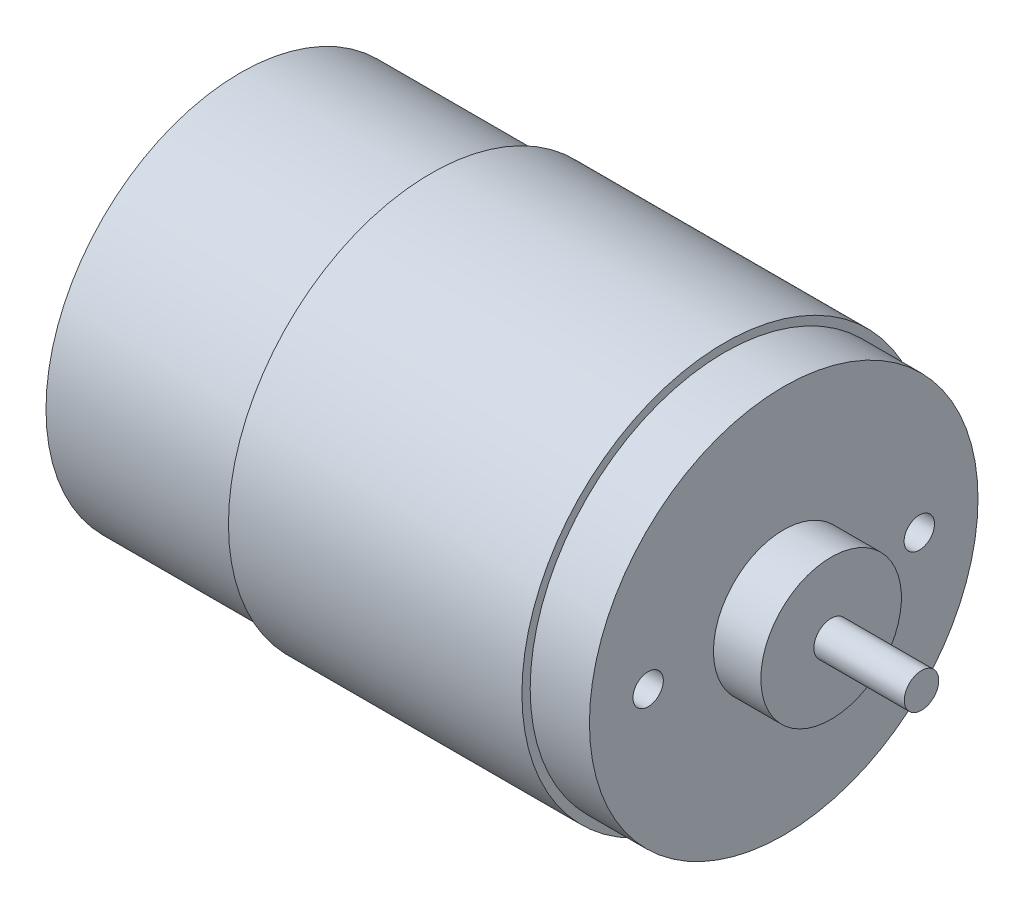
ISO-10303-21;
HEADER;
FILE_DESCRIPTION(('STEP AP214'),'2;1');
FILE_NAME('part.step','',(''),(''),'','','');
FILE_SCHEMA(('AUTOMOTIVE_DESIGN { 1 0 10303 214 1 1 1 1 }'));
ENDSEC;
DATA;
#1=APPLICATION_CONTEXT('core data for automotive mechanical design processes');
#2=APPLICATION_PROTOCOL_DEFINITION('international standard','automotive_design',2000,#1);
#3=PRODUCT_CONTEXT('',#1,'mechanical');
#4=PRODUCT('Part','Part','',(#3));
#5=PRODUCT_RELATED_PRODUCT_CATEGORY('part','',(#4));
#6=PRODUCT_DEFINITION_FORMATION('','',#4);
#7=PRODUCT_DEFINITION_CONTEXT('part definition',#1,'design');
#8=PRODUCT_DEFINITION('design','',#6,#7);
#9=PRODUCT_DEFINITION_SHAPE('','',#8);
#10=(LENGTH_UNIT() NAMED_UNIT(*) SI_UNIT(.MILLI.,.METRE.));
#11=(NAMED_UNIT(*) PLANE_ANGLE_UNIT() SI_UNIT($,.RADIAN.));
#12=(NAMED_UNIT(*) SI_UNIT($,.STERADIAN.) SOLID_ANGLE_UNIT());
#13=UNCERTAINTY_MEASURE_WITH_UNIT(LENGTH_MEASURE(1.E-05),#10,'distance_accuracy_value','');
#14=(GEOMETRIC_REPRESENTATION_CONTEXT(3) GLOBAL_UNCERTAINTY_ASSIGNED_CONTEXT((#13)) GLOBAL_UNIT_ASSIGNED_CONTEXT((#10,
#11,#12)) REPRESENTATION_CONTEXT('',''));
#15=CARTESIAN_POINT('',(0.,0.,0.));
#16=DIRECTION('',(0.,0.,1.));
#17=DIRECTION('',(1.,0.,0.));
#18=AXIS2_PLACEMENT_3D('',#15,#16,#17);
#19=CARTESIAN_POINT('',(-29.8040836820084,0.,0.));
#20=DIRECTION('',(1.,0.,0.));
#21=DIRECTION('',(0.,0.,-1.));
#22=AXIS2_PLACEMENT_3D('',#19,#20,#21);
#23=PLANE('',#22);
#24=CARTESIAN_POINT('',(-29.8040836820084,0.,0.));
#25=DIRECTION('',(-1.,0.,0.));
#26=DIRECTION('',(0.,0.,1.));
#27=AXIS2_PLACEMENT_3D('',#24,#25,#26);
#28=CIRCLE('',#27,1.53462761506276);
#29=CARTESIAN_POINT('',(-29.8040836820084,0.,1.53462761506276));
#30=VERTEX_POINT('',#29);
#31=EDGE_CURVE('E10',#30,#30,#28,.T.);
#32=ORIENTED_EDGE('',*,*,#31,.T.);
#33=EDGE_LOOP('',(#32));
#34=FACE_BOUND('',#33,.T.);
#35=ADVANCED_FACE('F33',(#34),#23,.F.);
#36=CARTESIAN_POINT('',(-37.6387615062761,0.,0.));
#37=DIRECTION('',(-1.,0.,0.));
#38=DIRECTION('',(0.,0.,1.));
#39=AXIS2_PLACEMENT_3D('',#36,#37,#38);
#40=CYLINDRICAL_SURFACE('',#39,1.53462761506276);
#41=ORIENTED_EDGE('',*,*,#31,.F.);
#42=EDGE_LOOP('',(#41));
#43=FACE_BOUND('',#42,.T.);
#44=CARTESIAN_POINT('',(-28.9156150627615,0.,0.));
#45=DIRECTION('',(-1.,0.,0.));
#46=DIRECTION('',(0.,0.,1.));
#47=AXIS2_PLACEMENT_3D('',#44,#45,#46);
#48=CIRCLE('',#47,1.53462761506276);
#49=CARTESIAN_POINT('',(-28.9156150627615,0.,1.53462761506276));
#50=VERTEX_POINT('',#49);
#51=EDGE_CURVE('E39',#50,#50,#48,.T.);
#52=ORIENTED_EDGE('',*,*,#51,.T.);
#53=EDGE_LOOP('',(#52));
#54=FACE_BOUND('',#53,.T.);
#55=ADVANCED_FACE('F152',(#43,#54),#40,.T.);
#56=CARTESIAN_POINT('',(-28.9156150627615,1.53462761506276,0.));
#57=DIRECTION('',(1.,0.,0.));
#58=DIRECTION('',(0.,0.,-1.));
#59=AXIS2_PLACEMENT_3D('',#56,#57,#58);
#60=PLANE('',#59);
#61=ORIENTED_EDGE('',*,*,#51,.F.);
#62=EDGE_LOOP('',(#61));
#63=FACE_BOUND('',#62,.T.);
#64=CARTESIAN_POINT('',(-28.9156150627615,0.,0.));
#65=DIRECTION('',(-1.,0.,0.));
#66=DIRECTION('',(0.,0.,1.));
#67=AXIS2_PLACEMENT_3D('',#64,#65,#66);
#68=CIRCLE('',#67,2.66540585774058);
#69=CARTESIAN_POINT('',(-28.9156150627615,0.,2.66540585774058));
#70=VERTEX_POINT('',#69);
#71=EDGE_CURVE('E43',#70,#70,#68,.T.);
#72=ORIENTED_EDGE('',*,*,#71,.T.);
#73=EDGE_LOOP('',(#72));
#74=FACE_BOUND('',#73,.T.);
#75=ADVANCED_FACE('F156',(#63,#74),#60,.F.);
#76=CARTESIAN_POINT('',(-37.6387615062761,0.,0.));
#77=DIRECTION('',(-1.,0.,0.));
#78=DIRECTION('',(0.,0.,1.));
#79=AXIS2_PLACEMENT_3D('',#76,#77,#78);
#80=CYLINDRICAL_SURFACE('',#79,2.66540585774058);
#81=ORIENTED_EDGE('',*,*,#71,.F.);
#82=EDGE_LOOP('',(#81));
#83=FACE_BOUND('',#82,.T.);
#84=CARTESIAN_POINT('',(-27.6232970711297,0.,0.));
#85=DIRECTION('',(-1.,0.,0.));
#86=DIRECTION('',(0.,0.,1.));
#87=AXIS2_PLACEMENT_3D('',#84,#85,#86);
#88=CIRCLE('',#87,2.66540585774058);
#89=CARTESIAN_POINT('',(-27.6232970711297,0.,2.66540585774058));
#90=VERTEX_POINT('',#89);
#91=EDGE_CURVE('E47',#90,#90,#88,.T.);
#92=ORIENTED_EDGE('',*,*,#91,.T.);
#93=EDGE_LOOP('',(#92));
#94=FACE_BOUND('',#93,.T.);
#95=ADVANCED_FACE('F161',(#83,#94),#80,.T.);
#96=CARTESIAN_POINT('',(-27.6232970711297,2.66540585774058,0.));
#97=DIRECTION('',(1.,0.,0.));
#98=DIRECTION('',(0.,0.,-1.));
#99=AXIS2_PLACEMENT_3D('',#96,#97,#98);
#100=PLANE('',#99);
#101=ORIENTED_EDGE('',*,*,#91,.F.);
#102=EDGE_LOOP('',(#101));
#103=FACE_BOUND('',#102,.T.);
#104=CARTESIAN_POINT('',(-27.6232970711297,0.,0.));
#105=DIRECTION('',(-1.,0.,0.));
#106=DIRECTION('',(0.,0.,1.));
#107=AXIS2_PLACEMENT_3D('',#104,#105,#106);
#108=CIRCLE('',#107,4.76542259414226);
#109=CARTESIAN_POINT('',(-27.6232970711297,0.,4.76542259414226));
#110=VERTEX_POINT('',#109);
#111=EDGE_CURVE('E52',#110,#110,#108,.T.);
#112=ORIENTED_EDGE('',*,*,#111,.T.);
#113=EDGE_LOOP('',(#112));
#114=FACE_BOUND('',#113,.T.);
#115=ADVANCED_FACE('F167',(#103,#114),#100,.F.);
#116=CARTESIAN_POINT('',(-26.6944435146444,0.,0.));
#117=DIRECTION('',(1.,0.,0.));
#118=DIRECTION('',(0.,0.,-1.));
#119=AXIS2_PLACEMENT_3D('',#116,#117,#118);
#120=CONICAL_SURFACE('',#119,5.69427615062763,0.785398163397459);
#121=ORIENTED_EDGE('',*,*,#111,.F.);
#122=EDGE_LOOP('',(#121));
#123=FACE_BOUND('',#122,.T.);
#124=CARTESIAN_POINT('',(-26.6944435146444,0.,0.));
#125=DIRECTION('',(-1.,0.,0.));
#126=DIRECTION('',(0.,0.,1.));
#127=AXIS2_PLACEMENT_3D('',#124,#125,#126);
#128=CIRCLE('',#127,5.69427615062763);
#129=CARTESIAN_POINT('',(-26.6944435146444,0.,5.69427615062763));
#130=VERTEX_POINT('',#129);
#131=EDGE_CURVE('E55',#130,#130,#128,.T.);
#132=ORIENTED_EDGE('',*,*,#131,.T.);
#133=EDGE_LOOP('',(#132));
#134=FACE_BOUND('',#133,.T.);
#135=ADVANCED_FACE('F171',(#123,#134),#120,.T.);
#136=CARTESIAN_POINT('',(-37.6387615062761,0.,0.));
#137=DIRECTION('',(-1.,0.,0.));
#138=DIRECTION('',(0.,0.,1.));
#139=AXIS2_PLACEMENT_3D('',#136,#137,#138);
#140=CYLINDRICAL_SURFACE('',#139,5.69427615062762);
#141=ORIENTED_EDGE('',*,*,#131,.F.);
#142=EDGE_LOOP('',(#141));
#143=FACE_BOUND('',#142,.T.);
#144=CARTESIAN_POINT('',(-24.6478836820084,0.,0.));
#145=DIRECTION('',(-1.,0.,0.));
#146=DIRECTION('',(0.,0.,1.));
#147=AXIS2_PLACEMENT_3D('',#144,#145,#146);
#148=CIRCLE('',#147,5.69427615062762);
#149=CARTESIAN_POINT('',(-24.6478836820084,0.,5.69427615062762));
#150=VERTEX_POINT('',#149);
#151=EDGE_CURVE('E58',#150,#150,#148,.T.);
#152=ORIENTED_EDGE('',*,*,#151,.T.);
#153=EDGE_LOOP('',(#152));
#154=FACE_BOUND('',#153,.T.);
#155=ADVANCED_FACE('F175',(#143,#154),#140,.T.);
#156=CARTESIAN_POINT('',(-24.6478836820084,5.69427615062762,0.));
#157=DIRECTION('',(1.,0.,0.));
#158=DIRECTION('',(0.,0.,-1.));
#159=AXIS2_PLACEMENT_3D('',#156,#157,#158);
#160=PLANE('',#159);
#161=ORIENTED_EDGE('',*,*,#151,.F.);
#162=EDGE_LOOP('',(#161));
#163=FACE_BOUND('',#162,.T.);
#164=CARTESIAN_POINT('',(-24.6478836820084,0.,0.));
#165=DIRECTION('',(-1.,0.,0.));
#166=DIRECTION('',(0.,0.,1.));
#167=AXIS2_PLACEMENT_3D('',#164,#165,#166);
#168=CIRCLE('',#167,17.907);
#169=CARTESIAN_POINT('',(-24.6478836820084,0.,17.907));
#170=VERTEX_POINT('',#169);
#171=EDGE_CURVE('E61',#170,#170,#168,.T.);
#172=ORIENTED_EDGE('',*,*,#171,.T.);
#173=EDGE_LOOP('',(#172));
#174=FACE_BOUND('',#173,.T.);
#175=ADVANCED_FACE('F179',(#163,#174),#160,.F.);
#176=CARTESIAN_POINT('',(-37.6387615062761,0.,0.));
#177=DIRECTION('',(-1.,0.,0.));
#178=DIRECTION('',(0.,0.,1.));
#179=AXIS2_PLACEMENT_3D('',#176,#177,#178);
#180=CYLINDRICAL_SURFACE('',#179,17.907);
#181=ORIENTED_EDGE('',*,*,#171,.F.);
#182=EDGE_LOOP('',(#181));
#183=FACE_BOUND('',#182,.T.);
#184=CARTESIAN_POINT('',(-7.07108368200839,0.,0.));
#185=DIRECTION('',(-1.,0.,0.));
#186=DIRECTION('',(0.,0.,1.));
#187=AXIS2_PLACEMENT_3D('',#184,#185,#186);
#188=CIRCLE('',#187,17.907);
#189=CARTESIAN_POINT('',(-7.07108368200839,0.,17.907));
#190=VERTEX_POINT('',#189);
#191=EDGE_CURVE('E64',#190,#190,#188,.T.);
#192=ORIENTED_EDGE('',*,*,#191,.T.);
#193=EDGE_LOOP('',(#192));
#194=FACE_BOUND('',#193,.T.);
#195=ADVANCED_FACE('F183',(#183,#194),#180,.T.);
#196=CARTESIAN_POINT('',(-7.07108368200839,17.907,0.));
#197=DIRECTION('',(1.,0.,0.));
#198=DIRECTION('',(0.,0.,-1.));
#199=AXIS2_PLACEMENT_3D('',#196,#197,#198);
#200=PLANE('',#199);
#201=ORIENTED_EDGE('',*,*,#191,.F.);
#202=EDGE_LOOP('',(#201));
#203=FACE_BOUND('',#202,.T.);
#204=CARTESIAN_POINT('',(-7.07108368200839,0.,0.));
#205=DIRECTION('',(-1.,0.,0.));
#206=DIRECTION('',(0.,0.,1.));
#207=AXIS2_PLACEMENT_3D('',#204,#205,#206);
#208=CIRCLE('',#207,18.669);
#209=CARTESIAN_POINT('',(-7.07108368200839,0.,18.669));
#210=VERTEX_POINT('',#209);
#211=EDGE_CURVE('E67',#210,#210,#208,.T.);
#212=ORIENTED_EDGE('',*,*,#211,.T.);
#213=EDGE_LOOP('',(#212));
#214=FACE_BOUND('',#213,.T.);
#215=ADVANCED_FACE('F187',(#203,#214),#200,.F.);
#216=CARTESIAN_POINT('',(-37.6387615062761,0.,0.));
#217=DIRECTION('',(-1.,0.,0.));
#218=DIRECTION('',(0.,0.,1.));
#219=AXIS2_PLACEMENT_3D('',#216,#217,#218);
#220=CYLINDRICAL_SURFACE('',#219,18.669);
#221=ORIENTED_EDGE('',*,*,#211,.F.);
#222=EDGE_LOOP('',(#221));
#223=FACE_BOUND('',#222,.T.);
#224=CARTESIAN_POINT('',(19.9799163179916,0.,0.));
#225=DIRECTION('',(-1.,0.,0.));
#226=DIRECTION('',(0.,0.,1.));
#227=AXIS2_PLACEMENT_3D('',#224,#225,#226);
#228=CIRCLE('',#227,18.669);
#229=CARTESIAN_POINT('',(19.9799163179916,0.,18.669));
#230=VERTEX_POINT('',#229);
#231=EDGE_CURVE('E70',#230,#230,#228,.T.);
#232=ORIENTED_EDGE('',*,*,#231,.T.);
#233=EDGE_LOOP('',(#232));
#234=FACE_BOUND('',#233,.T.);
#235=ADVANCED_FACE('F191',(#223,#234),#220,.T.);
#236=CARTESIAN_POINT('',(19.9799163179916,18.669,0.));
#237=DIRECTION('',(-1.,0.,0.));
#238=DIRECTION('',(0.,0.,1.));
#239=AXIS2_PLACEMENT_3D('',#236,#237,#238);
#240=PLANE('',#239);
#241=ORIENTED_EDGE('',*,*,#231,.F.);
#242=EDGE_LOOP('',(#241));
#243=FACE_BOUND('',#242,.T.);
#244=CARTESIAN_POINT('',(19.9799163179916,0.,0.));
#245=DIRECTION('',(-1.,0.,0.));
#246=DIRECTION('',(0.,0.,1.));
#247=AXIS2_PLACEMENT_3D('',#244,#245,#246);
#248=CIRCLE('',#247,17.907);
#249=CARTESIAN_POINT('',(19.9799163179916,0.,17.907));
#250=VERTEX_POINT('',#249);
#251=EDGE_CURVE('E73',#250,#250,#248,.T.);
#252=ORIENTED_EDGE('',*,*,#251,.T.);
#253=EDGE_LOOP('',(#252));
#254=FACE_BOUND('',#253,.T.);
#255=ADVANCED_FACE('F195',(#243,#254),#240,.F.);
#256=CARTESIAN_POINT('',(-37.6387615062761,0.,0.));
#257=DIRECTION('',(-1.,0.,0.));
#258=DIRECTION('',(0.,0.,1.));
#259=AXIS2_PLACEMENT_3D('',#256,#257,#258);
#260=CYLINDRICAL_SURFACE('',#259,17.907);
#261=ORIENTED_EDGE('',*,*,#251,.F.);
#262=EDGE_LOOP('',(#261));
#263=FACE_BOUND('',#262,.T.);
#264=CARTESIAN_POINT('',(25.4409163179916,0.,0.));
#265=DIRECTION('',(-1.,0.,0.));
#266=DIRECTION('',(0.,0.,1.));
#267=AXIS2_PLACEMENT_3D('',#264,#265,#266);
#268=CIRCLE('',#267,17.907);
#269=CARTESIAN_POINT('',(25.4409163179916,0.,17.907));
#270=VERTEX_POINT('',#269);
#271=EDGE_CURVE('E76',#270,#270,#268,.T.);
#272=ORIENTED_EDGE('',*,*,#271,.T.);
#273=EDGE_LOOP('',(#272));
#274=FACE_BOUND('',#273,.T.);
#275=ADVANCED_FACE('F117',(#263,#274),#260,.T.);
#276=CARTESIAN_POINT('',(25.4409163179916,17.907,0.));
#277=DIRECTION('',(-1.,0.,0.));
#278=DIRECTION('',(0.,0.,1.));
#279=AXIS2_PLACEMENT_3D('',#276,#277,#278);
#280=PLANE('',#279);
#281=CARTESIAN_POINT('',(25.4409163179916,0.,-12.4968));
#282=DIRECTION('',(1.,0.,0.));
#283=DIRECTION('',(0.,0.,1.));
#284=AXIS2_PLACEMENT_3D('',#281,#282,#283);
#285=CIRCLE('',#284,1.4);
#286=CARTESIAN_POINT('',(25.4409163179916,0.,-11.0968));
#287=VERTEX_POINT('',#286);
#288=EDGE_CURVE('E98',#287,#287,#285,.T.);
#289=ORIENTED_EDGE('',*,*,#288,.F.);
#290=EDGE_LOOP('',(#289));
#291=FACE_BOUND('',#290,.T.);
#292=CARTESIAN_POINT('',(25.4409163179916,0.,12.4968));
#293=DIRECTION('',(1.,0.,0.));
#294=DIRECTION('',(0.,0.,-1.));
#295=AXIS2_PLACEMENT_3D('',#292,#293,#294);
#296=CIRCLE('',#295,1.4);
#297=CARTESIAN_POINT('',(25.4409163179916,0.,11.0968));
#298=VERTEX_POINT('',#297);
#299=EDGE_CURVE('E92',#298,#298,#296,.T.);
#300=ORIENTED_EDGE('',*,*,#299,.F.);
#301=EDGE_LOOP('',(#300));
#302=FACE_BOUND('',#301,.T.);
#303=ORIENTED_EDGE('',*,*,#271,.F.);
#304=EDGE_LOOP('',(#303));
#305=FACE_BOUND('',#304,.T.);
#306=CARTESIAN_POINT('',(25.4409163179916,0.,0.));
#307=DIRECTION('',(-1.,0.,0.));
#308=DIRECTION('',(0.,0.,1.));
#309=AXIS2_PLACEMENT_3D('',#306,#307,#308);
#310=CIRCLE('',#309,6.477);
#311=CARTESIAN_POINT('',(25.4409163179916,0.,6.477));
#312=VERTEX_POINT('',#311);
#313=EDGE_CURVE('E79',#312,#312,#310,.T.);
#314=ORIENTED_EDGE('',*,*,#313,.T.);
#315=EDGE_LOOP('',(#314));
#316=FACE_BOUND('',#315,.T.);
#317=ADVANCED_FACE('F113',(#291,#302,#305,#316),#280,.F.);
#318=CARTESIAN_POINT('',(-37.6387615062761,0.,0.));
#319=DIRECTION('',(-1.,0.,0.));
#320=DIRECTION('',(0.,0.,1.));
#321=AXIS2_PLACEMENT_3D('',#318,#319,#320);
#322=CYLINDRICAL_SURFACE('',#321,6.477);
#323=ORIENTED_EDGE('',*,*,#313,.F.);
#324=EDGE_LOOP('',(#323));
#325=FACE_BOUND('',#324,.T.);
#326=CARTESIAN_POINT('',(29.8097163179916,0.,0.));
#327=DIRECTION('',(-1.,0.,0.));
#328=DIRECTION('',(0.,0.,1.));
#329=AXIS2_PLACEMENT_3D('',#326,#327,#328);
#330=CIRCLE('',#329,6.477);
#331=CARTESIAN_POINT('',(29.8097163179916,0.,6.477));
#332=VERTEX_POINT('',#331);
#333=EDGE_CURVE('E82',#332,#332,#330,.T.);
#334=ORIENTED_EDGE('',*,*,#333,.T.);
#335=EDGE_LOOP('',(#334));
#336=FACE_BOUND('',#335,.T.);
#337=ADVANCED_FACE('F116',(#325,#336),#322,.T.);
#338=CARTESIAN_POINT('',(29.8097163179916,6.477,0.));
#339=DIRECTION('',(-1.,0.,0.));
#340=DIRECTION('',(0.,0.,1.));
#341=AXIS2_PLACEMENT_3D('',#338,#339,#340);
#342=PLANE('',#341);
#343=ORIENTED_EDGE('',*,*,#333,.F.);
#344=EDGE_LOOP('',(#343));
#345=FACE_BOUND('',#344,.T.);
#346=CARTESIAN_POINT('',(29.8097163179916,0.,0.));
#347=DIRECTION('',(-1.,0.,0.));
#348=DIRECTION('',(0.,0.,1.));
#349=AXIS2_PLACEMENT_3D('',#346,#347,#348);
#350=CIRCLE('',#349,1.5875);
#351=CARTESIAN_POINT('',(29.8097163179916,0.,1.5875));
#352=VERTEX_POINT('',#351);
#353=EDGE_CURVE('E85',#352,#352,#350,.T.);
#354=ORIENTED_EDGE('',*,*,#353,.T.);
#355=EDGE_LOOP('',(#354));
#356=FACE_BOUND('',#355,.T.);
#357=ADVANCED_FACE('F127',(#345,#356),#342,.F.);
#358=CARTESIAN_POINT('',(-37.6387615062761,0.,0.));
#359=DIRECTION('',(-1.,0.,0.));
#360=DIRECTION('',(0.,0.,1.));
#361=AXIS2_PLACEMENT_3D('',#358,#359,#360);
#362=CYLINDRICAL_SURFACE('',#361,1.5875);
#363=ORIENTED_EDGE('',*,*,#353,.F.);
#364=EDGE_LOOP('',(#363));
#365=FACE_BOUND('',#364,.T.);
#366=CARTESIAN_POINT('',(38.1409163179916,0.,0.));
#367=DIRECTION('',(-1.,0.,0.));
#368=DIRECTION('',(0.,0.,1.));
#369=AXIS2_PLACEMENT_3D('',#366,#367,#368);
#370=CIRCLE('',#369,1.5875);
#371=CARTESIAN_POINT('',(38.1409163179916,0.,1.5875));
#372=VERTEX_POINT('',#371);
#373=EDGE_CURVE('E88',#372,#372,#370,.T.);
#374=ORIENTED_EDGE('',*,*,#373,.T.);
#375=EDGE_LOOP('',(#374));
#376=FACE_BOUND('',#375,.T.);
#377=ADVANCED_FACE('F133',(#365,#376),#362,.T.);
#378=CARTESIAN_POINT('',(38.1409163179916,1.5875,0.));
#379=DIRECTION('',(-1.,0.,0.));
#380=DIRECTION('',(0.,0.,1.));
#381=AXIS2_PLACEMENT_3D('',#378,#379,#380);
#382=PLANE('',#381);
#383=ORIENTED_EDGE('',*,*,#373,.F.);
#384=EDGE_LOOP('',(#383));
#385=FACE_BOUND('',#384,.T.);
#386=ADVANCED_FACE('F139',(#385),#382,.F.);
#387=CARTESIAN_POINT('',(19.0909163179916,0.,12.4968));
#388=DIRECTION('',(1.,0.,0.));
#389=DIRECTION('',(0.,0.,-1.));
#390=AXIS2_PLACEMENT_3D('',#387,#388,#389);
#391=CYLINDRICAL_SURFACE('',#390,1.4);
#392=CARTESIAN_POINT('',(19.0909163179916,0.,12.4968));
#393=DIRECTION('',(1.,0.,0.));
#394=DIRECTION('',(0.,0.,-1.));
#395=AXIS2_PLACEMENT_3D('',#392,#393,#394);
#396=CIRCLE('',#395,1.4);
#397=CARTESIAN_POINT('',(19.0909163179916,0.,11.0968));
#398=VERTEX_POINT('',#397);
#399=EDGE_CURVE('E91',#398,#398,#396,.T.);
#400=ORIENTED_EDGE('',*,*,#399,.F.);
#401=EDGE_LOOP('',(#400));
#402=FACE_BOUND('',#401,.T.);
#403=ORIENTED_EDGE('',*,*,#299,.T.);
#404=EDGE_LOOP('',(#403));
#405=FACE_BOUND('',#404,.T.);
#406=ADVANCED_FACE('F144',(#402,#405),#391,.F.);
#407=CARTESIAN_POINT('',(19.0909163179916,0.,12.4968));
#408=DIRECTION('',(1.,0.,0.));
#409=DIRECTION('',(0.,0.,-1.));
#410=AXIS2_PLACEMENT_3D('',#407,#408,#409);
#411=PLANE('',#410);
#412=ORIENTED_EDGE('',*,*,#399,.T.);
#413=EDGE_LOOP('',(#412));
#414=FACE_BOUND('',#413,.T.);
#415=ADVANCED_FACE('F109',(#414),#411,.T.);
#416=CARTESIAN_POINT('',(19.0909163179916,0.,-12.4968));
#417=DIRECTION('',(1.,0.,0.));
#418=DIRECTION('',(0.,0.,-1.));
#419=AXIS2_PLACEMENT_3D('',#416,#417,#418);
#420=CYLINDRICAL_SURFACE('',#419,1.4);
#421=CARTESIAN_POINT('',(19.0909163179916,0.,-12.4968));
#422=DIRECTION('',(1.,0.,0.));
#423=DIRECTION('',(0.,0.,1.));
#424=AXIS2_PLACEMENT_3D('',#421,#422,#423);
#425=CIRCLE('',#424,1.4);
#426=CARTESIAN_POINT('',(19.0909163179916,0.,-11.0968));
#427=VERTEX_POINT('',#426);
#428=EDGE_CURVE('E95',#427,#427,#425,.T.);
#429=ORIENTED_EDGE('',*,*,#428,.F.);
#430=EDGE_LOOP('',(#429));
#431=FACE_BOUND('',#430,.T.);
#432=ORIENTED_EDGE('',*,*,#288,.T.);
#433=EDGE_LOOP('',(#432));
#434=FACE_BOUND('',#433,.T.);
#435=ADVANCED_FACE('F106',(#431,#434),#420,.F.);
#436=CARTESIAN_POINT('',(19.0909163179916,0.,-12.4968));
#437=DIRECTION('',(-1.,0.,0.));
#438=DIRECTION('',(0.,0.,1.));
#439=AXIS2_PLACEMENT_3D('',#436,#437,#438);
#440=PLANE('',#439);
#441=ORIENTED_EDGE('',*,*,#428,.T.);
#442=EDGE_LOOP('',(#441));
#443=FACE_BOUND('',#442,.T.);
#444=ADVANCED_FACE('F104',(#443),#440,.F.);
#445=CLOSED_SHELL('',(#35,#55,#75,#95,#115,#135,#155,#175,#195,#215,#235,#255,#275,#317,#337,
#357,#377,#386,#406,#415,#435,#444));
#446=MANIFOLD_SOLID_BREP('B2',#445);
#447=ADVANCED_BREP_SHAPE_REPRESENTATION('',(#18,#446),#14);
#448=SHAPE_DEFINITION_REPRESENTATION(#9,#447);
ENDSEC;
END-ISO-10303-21;
